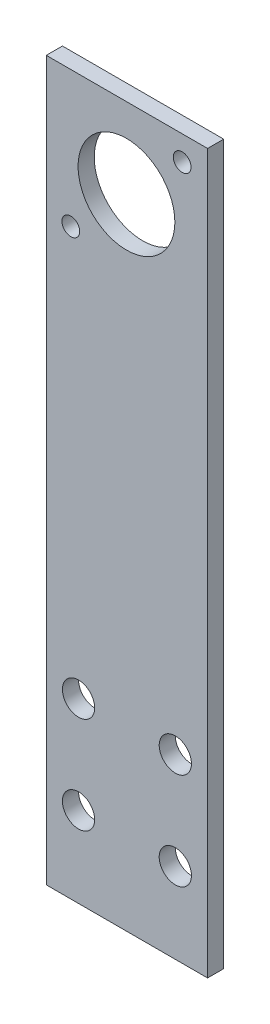
ISO-10303-21;
HEADER;
FILE_DESCRIPTION(('STEP AP214'),'2;1');
FILE_NAME('part.step','',(''),(''),'','','');
FILE_SCHEMA(('AUTOMOTIVE_DESIGN { 1 0 10303 214 1 1 1 1 }'));
ENDSEC;
DATA;
#1=APPLICATION_CONTEXT('core data for automotive mechanical design processes');
#2=APPLICATION_PROTOCOL_DEFINITION('international standard','automotive_design',2000,#1);
#3=PRODUCT_CONTEXT('',#1,'mechanical');
#4=PRODUCT('Part','Part','',(#3));
#5=PRODUCT_RELATED_PRODUCT_CATEGORY('part','',(#4));
#6=PRODUCT_DEFINITION_FORMATION('','',#4);
#7=PRODUCT_DEFINITION_CONTEXT('part definition',#1,'design');
#8=PRODUCT_DEFINITION('design','',#6,#7);
#9=PRODUCT_DEFINITION_SHAPE('','',#8);
#10=(LENGTH_UNIT() NAMED_UNIT(*) SI_UNIT(.MILLI.,.METRE.));
#11=(NAMED_UNIT(*) PLANE_ANGLE_UNIT() SI_UNIT($,.RADIAN.));
#12=(NAMED_UNIT(*) SI_UNIT($,.STERADIAN.) SOLID_ANGLE_UNIT());
#13=UNCERTAINTY_MEASURE_WITH_UNIT(LENGTH_MEASURE(1.E-05),#10,'distance_accuracy_value','');
#14=(GEOMETRIC_REPRESENTATION_CONTEXT(3) GLOBAL_UNCERTAINTY_ASSIGNED_CONTEXT((#13)) GLOBAL_UNIT_ASSIGNED_CONTEXT((#10,
#11,#12)) REPRESENTATION_CONTEXT('',''));
#15=CARTESIAN_POINT('',(0.,0.,0.));
#16=DIRECTION('',(0.,0.,1.));
#17=DIRECTION('',(1.,0.,0.));
#18=AXIS2_PLACEMENT_3D('',#15,#16,#17);
#19=CARTESIAN_POINT('',(0.,0.,3.175));
#20=DIRECTION('',(1.,0.,0.));
#21=DIRECTION('',(0.,0.,-1.));
#22=AXIS2_PLACEMENT_3D('',#19,#20,#21);
#23=PLANE('',#22);
#24=DIRECTION('',(0.,-1.,0.));
#25=VECTOR('',#24,1.);
#26=CARTESIAN_POINT('',(0.,0.,0.));
#27=LINE('',#26,#25);
#28=CARTESIAN_POINT('',(0.,147.32,0.));
#29=VERTEX_POINT('',#28);
#30=CARTESIAN_POINT('',(0.,5.9055,0.));
#31=VERTEX_POINT('',#30);
#32=EDGE_CURVE('E81',#29,#31,#27,.T.);
#33=ORIENTED_EDGE('',*,*,#32,.T.);
#34=DIRECTION('',(0.,0.,1.));
#35=VECTOR('',#34,1.);
#36=CARTESIAN_POINT('',(0.,5.9055,-0.00100000000000013));
#37=LINE('',#36,#35);
#38=CARTESIAN_POINT('',(0.,5.9055,3.175));
#39=VERTEX_POINT('',#38);
#40=EDGE_CURVE('E47',#31,#39,#37,.T.);
#41=ORIENTED_EDGE('',*,*,#40,.T.);
#42=DIRECTION('',(0.,-1.,0.));
#43=VECTOR('',#42,1.);
#44=CARTESIAN_POINT('',(0.,0.,3.175));
#45=LINE('',#44,#43);
#46=CARTESIAN_POINT('',(0.,147.32,3.175));
#47=VERTEX_POINT('',#46);
#48=EDGE_CURVE('E76',#47,#39,#45,.T.);
#49=ORIENTED_EDGE('',*,*,#48,.F.);
#50=DIRECTION('',(0.,0.,-1.));
#51=VECTOR('',#50,1.);
#52=CARTESIAN_POINT('',(0.,147.32,3.175));
#53=LINE('',#52,#51);
#54=EDGE_CURVE('E40',#47,#29,#53,.T.);
#55=ORIENTED_EDGE('',*,*,#54,.T.);
#56=EDGE_LOOP('',(#33,#41,#49,#55));
#57=FACE_BOUND('',#56,.T.);
#58=ADVANCED_FACE('F33',(#57),#23,.F.);
#59=CARTESIAN_POINT('',(31.75,0.,3.175));
#60=DIRECTION('',(-1.,0.,0.));
#61=DIRECTION('',(0.,0.,1.));
#62=AXIS2_PLACEMENT_3D('',#59,#60,#61);
#63=PLANE('',#62);
#64=DIRECTION('',(0.,1.,0.));
#65=VECTOR('',#64,1.);
#66=CARTESIAN_POINT('',(31.75,0.,3.175));
#67=LINE('',#66,#65);
#68=CARTESIAN_POINT('',(31.75,5.9055,3.175));
#69=VERTEX_POINT('',#68);
#70=CARTESIAN_POINT('',(31.75,147.32,3.175));
#71=VERTEX_POINT('',#70);
#72=EDGE_CURVE('E90',#69,#71,#67,.T.);
#73=ORIENTED_EDGE('',*,*,#72,.F.);
#74=DIRECTION('',(0.,0.,1.));
#75=VECTOR('',#74,1.);
#76=CARTESIAN_POINT('',(31.75,5.9055,-0.00100000000000013));
#77=LINE('',#76,#75);
#78=CARTESIAN_POINT('',(31.75,5.9055,0.));
#79=VERTEX_POINT('',#78);
#80=EDGE_CURVE('E86',#79,#69,#77,.T.);
#81=ORIENTED_EDGE('',*,*,#80,.F.);
#82=DIRECTION('',(0.,1.,0.));
#83=VECTOR('',#82,1.);
#84=CARTESIAN_POINT('',(31.75,0.,0.));
#85=LINE('',#84,#83);
#86=CARTESIAN_POINT('',(31.75,147.32,0.));
#87=VERTEX_POINT('',#86);
#88=EDGE_CURVE('E77',#79,#87,#85,.T.);
#89=ORIENTED_EDGE('',*,*,#88,.T.);
#90=DIRECTION('',(0.,0.,-1.));
#91=VECTOR('',#90,1.);
#92=CARTESIAN_POINT('',(31.75,147.32,3.175));
#93=LINE('',#92,#91);
#94=EDGE_CURVE('E11',#71,#87,#93,.T.);
#95=ORIENTED_EDGE('',*,*,#94,.F.);
#96=EDGE_LOOP('',(#73,#81,#89,#95));
#97=FACE_BOUND('',#96,.T.);
#98=ADVANCED_FACE('F159',(#97),#63,.F.);
#99=CARTESIAN_POINT('',(0.,147.32,3.175));
#100=DIRECTION('',(0.,-1.,0.));
#101=DIRECTION('',(0.,0.,-1.));
#102=AXIS2_PLACEMENT_3D('',#99,#100,#101);
#103=PLANE('',#102);
#104=DIRECTION('',(-1.,0.,0.));
#105=VECTOR('',#104,1.);
#106=CARTESIAN_POINT('',(0.,147.32,0.));
#107=LINE('',#106,#105);
#108=EDGE_CURVE('E68',#87,#29,#107,.T.);
#109=ORIENTED_EDGE('',*,*,#108,.T.);
#110=ORIENTED_EDGE('',*,*,#54,.F.);
#111=DIRECTION('',(-1.,0.,0.));
#112=VECTOR('',#111,1.);
#113=CARTESIAN_POINT('',(0.,147.32,3.175));
#114=LINE('',#113,#112);
#115=EDGE_CURVE('E56',#71,#47,#114,.T.);
#116=ORIENTED_EDGE('',*,*,#115,.F.);
#117=ORIENTED_EDGE('',*,*,#94,.T.);
#118=EDGE_LOOP('',(#109,#110,#116,#117));
#119=FACE_BOUND('',#118,.T.);
#120=ADVANCED_FACE('F70',(#119),#103,.F.);
#121=CARTESIAN_POINT('',(0.,0.,3.175));
#122=DIRECTION('',(0.,0.,-1.));
#123=DIRECTION('',(-1.,0.,0.));
#124=AXIS2_PLACEMENT_3D('',#121,#122,#123);
#125=PLANE('',#124);
#126=CARTESIAN_POINT('',(15.7861000000004,131.5339,3.175));
#127=DIRECTION('',(0.,0.,1.));
#128=DIRECTION('',(1.,0.,0.));
#129=AXIS2_PLACEMENT_3D('',#126,#127,#128);
#130=CIRCLE('',#129,9.525);
#131=CARTESIAN_POINT('',(25.3111000000004,131.5339,3.175));
#132=VERTEX_POINT('',#131);
#133=EDGE_CURVE('E129',#132,#132,#130,.T.);
#134=ORIENTED_EDGE('',*,*,#133,.F.);
#135=EDGE_LOOP('',(#134));
#136=FACE_BOUND('',#135,.T.);
#137=CARTESIAN_POINT('',(26.7462000000004,142.494,3.175));
#138=DIRECTION('',(0.,0.,1.));
#139=DIRECTION('',(1.,0.,0.));
#140=AXIS2_PLACEMENT_3D('',#137,#138,#139);
#141=CIRCLE('',#140,1.7526);
#142=CARTESIAN_POINT('',(28.4988000000004,142.494,3.175));
#143=VERTEX_POINT('',#142);
#144=EDGE_CURVE('E135',#143,#143,#141,.T.);
#145=ORIENTED_EDGE('',*,*,#144,.F.);
#146=EDGE_LOOP('',(#145));
#147=FACE_BOUND('',#146,.T.);
#148=CARTESIAN_POINT('',(4.82600000000036,120.5738,3.175));
#149=DIRECTION('',(0.,0.,1.));
#150=DIRECTION('',(1.,0.,0.));
#151=AXIS2_PLACEMENT_3D('',#148,#149,#150);
#152=CIRCLE('',#151,1.7526);
#153=CARTESIAN_POINT('',(6.57860000000036,120.5738,3.175));
#154=VERTEX_POINT('',#153);
#155=EDGE_CURVE('E123',#154,#154,#152,.T.);
#156=ORIENTED_EDGE('',*,*,#155,.F.);
#157=EDGE_LOOP('',(#156));
#158=FACE_BOUND('',#157,.T.);
#159=CARTESIAN_POINT('',(25.4,21.7805,3.175));
#160=DIRECTION('',(0.,0.,1.));
#161=DIRECTION('',(1.,0.,0.));
#162=AXIS2_PLACEMENT_3D('',#159,#160,#161);
#163=CIRCLE('',#162,3.175);
#164=CARTESIAN_POINT('',(28.575,21.7805,3.175));
#165=VERTEX_POINT('',#164);
#166=EDGE_CURVE('E108',#165,#165,#163,.T.);
#167=ORIENTED_EDGE('',*,*,#166,.F.);
#168=EDGE_LOOP('',(#167));
#169=FACE_BOUND('',#168,.T.);
#170=CARTESIAN_POINT('',(6.35,21.7805,3.175));
#171=DIRECTION('',(0.,0.,1.));
#172=DIRECTION('',(1.,0.,0.));
#173=AXIS2_PLACEMENT_3D('',#170,#171,#172);
#174=CIRCLE('',#173,3.175);
#175=CARTESIAN_POINT('',(9.525,21.7805,3.175));
#176=VERTEX_POINT('',#175);
#177=EDGE_CURVE('E115',#176,#176,#174,.T.);
#178=ORIENTED_EDGE('',*,*,#177,.F.);
#179=EDGE_LOOP('',(#178));
#180=FACE_BOUND('',#179,.T.);
#181=CARTESIAN_POINT('',(6.35,40.8305,3.175));
#182=DIRECTION('',(0.,0.,1.));
#183=DIRECTION('',(1.,0.,0.));
#184=AXIS2_PLACEMENT_3D('',#181,#182,#183);
#185=CIRCLE('',#184,3.175);
#186=CARTESIAN_POINT('',(9.525,40.8305,3.175));
#187=VERTEX_POINT('',#186);
#188=EDGE_CURVE('E102',#187,#187,#185,.T.);
#189=ORIENTED_EDGE('',*,*,#188,.F.);
#190=EDGE_LOOP('',(#189));
#191=FACE_BOUND('',#190,.T.);
#192=CARTESIAN_POINT('',(25.4,40.8305,3.175));
#193=DIRECTION('',(0.,0.,1.));
#194=DIRECTION('',(1.,0.,0.));
#195=AXIS2_PLACEMENT_3D('',#192,#193,#194);
#196=CIRCLE('',#195,3.175);
#197=CARTESIAN_POINT('',(28.575,40.8305,3.175));
#198=VERTEX_POINT('',#197);
#199=EDGE_CURVE('E98',#198,#198,#196,.T.);
#200=ORIENTED_EDGE('',*,*,#199,.F.);
#201=EDGE_LOOP('',(#200));
#202=FACE_BOUND('',#201,.T.);
#203=ORIENTED_EDGE('',*,*,#48,.T.);
#204=DIRECTION('',(-1.,0.,0.));
#205=VECTOR('',#204,1.);
#206=CARTESIAN_POINT('',(0.,5.9055,3.175));
#207=LINE('',#206,#205);
#208=EDGE_CURVE('E94',#69,#39,#207,.T.);
#209=ORIENTED_EDGE('',*,*,#208,.F.);
#210=ORIENTED_EDGE('',*,*,#72,.T.);
#211=ORIENTED_EDGE('',*,*,#115,.T.);
#212=EDGE_LOOP('',(#203,#209,#210,#211));
#213=FACE_BOUND('',#212,.T.);
#214=ADVANCED_FACE('F167',(#136,#147,#158,#169,#180,#191,#202,#213),#125,.F.);
#215=CARTESIAN_POINT('',(0.,0.,0.));
#216=DIRECTION('',(0.,0.,-1.));
#217=DIRECTION('',(-1.,0.,0.));
#218=AXIS2_PLACEMENT_3D('',#215,#216,#217);
#219=PLANE('',#218);
#220=CARTESIAN_POINT('',(15.7861000000004,131.5339,0.));
#221=DIRECTION('',(0.,0.,1.));
#222=DIRECTION('',(1.,0.,0.));
#223=AXIS2_PLACEMENT_3D('',#220,#221,#222);
#224=CIRCLE('',#223,9.525);
#225=CARTESIAN_POINT('',(25.3111000000004,131.5339,0.));
#226=VERTEX_POINT('',#225);
#227=EDGE_CURVE('E126',#226,#226,#224,.T.);
#228=ORIENTED_EDGE('',*,*,#227,.T.);
#229=EDGE_LOOP('',(#228));
#230=FACE_BOUND('',#229,.T.);
#231=CARTESIAN_POINT('',(26.7462000000004,142.494,0.));
#232=DIRECTION('',(0.,0.,1.));
#233=DIRECTION('',(1.,0.,0.));
#234=AXIS2_PLACEMENT_3D('',#231,#232,#233);
#235=CIRCLE('',#234,1.7526);
#236=CARTESIAN_POINT('',(28.4988000000004,142.494,0.));
#237=VERTEX_POINT('',#236);
#238=EDGE_CURVE('E132',#237,#237,#235,.T.);
#239=ORIENTED_EDGE('',*,*,#238,.T.);
#240=EDGE_LOOP('',(#239));
#241=FACE_BOUND('',#240,.T.);
#242=CARTESIAN_POINT('',(4.82600000000036,120.5738,0.));
#243=DIRECTION('',(0.,0.,1.));
#244=DIRECTION('',(1.,0.,0.));
#245=AXIS2_PLACEMENT_3D('',#242,#243,#244);
#246=CIRCLE('',#245,1.7526);
#247=CARTESIAN_POINT('',(6.57860000000036,120.5738,0.));
#248=VERTEX_POINT('',#247);
#249=EDGE_CURVE('E109',#248,#248,#246,.T.);
#250=ORIENTED_EDGE('',*,*,#249,.T.);
#251=EDGE_LOOP('',(#250));
#252=FACE_BOUND('',#251,.T.);
#253=CARTESIAN_POINT('',(25.4,21.7805,0.));
#254=DIRECTION('',(0.,0.,-1.));
#255=DIRECTION('',(-1.,0.,0.));
#256=AXIS2_PLACEMENT_3D('',#253,#254,#255);
#257=CIRCLE('',#256,3.175);
#258=CARTESIAN_POINT('',(22.225,21.7805,0.));
#259=VERTEX_POINT('',#258);
#260=EDGE_CURVE('E105',#259,#259,#257,.F.);
#261=ORIENTED_EDGE('',*,*,#260,.T.);
#262=EDGE_LOOP('',(#261));
#263=FACE_BOUND('',#262,.T.);
#264=CARTESIAN_POINT('',(6.35,21.7805,0.));
#265=DIRECTION('',(0.,0.,-1.));
#266=DIRECTION('',(-1.,0.,0.));
#267=AXIS2_PLACEMENT_3D('',#264,#265,#266);
#268=CIRCLE('',#267,3.175);
#269=CARTESIAN_POINT('',(3.175,21.7805,0.));
#270=VERTEX_POINT('',#269);
#271=EDGE_CURVE('E112',#270,#270,#268,.F.);
#272=ORIENTED_EDGE('',*,*,#271,.T.);
#273=EDGE_LOOP('',(#272));
#274=FACE_BOUND('',#273,.T.);
#275=CARTESIAN_POINT('',(6.35,40.8305,0.));
#276=DIRECTION('',(0.,0.,-1.));
#277=DIRECTION('',(-1.,0.,0.));
#278=AXIS2_PLACEMENT_3D('',#275,#276,#277);
#279=CIRCLE('',#278,3.175);
#280=CARTESIAN_POINT('',(3.175,40.8305,0.));
#281=VERTEX_POINT('',#280);
#282=EDGE_CURVE('E118',#281,#281,#279,.F.);
#283=ORIENTED_EDGE('',*,*,#282,.T.);
#284=EDGE_LOOP('',(#283));
#285=FACE_BOUND('',#284,.T.);
#286=CARTESIAN_POINT('',(25.4,40.8305,0.));
#287=DIRECTION('',(0.,0.,-1.));
#288=DIRECTION('',(-1.,0.,0.));
#289=AXIS2_PLACEMENT_3D('',#286,#287,#288);
#290=CIRCLE('',#289,3.175);
#291=CARTESIAN_POINT('',(22.225,40.8305,0.));
#292=VERTEX_POINT('',#291);
#293=EDGE_CURVE('E99',#292,#292,#290,.F.);
#294=ORIENTED_EDGE('',*,*,#293,.T.);
#295=EDGE_LOOP('',(#294));
#296=FACE_BOUND('',#295,.T.);
#297=DIRECTION('',(-1.,0.,0.));
#298=VECTOR('',#297,1.);
#299=CARTESIAN_POINT('',(0.,5.9055,0.));
#300=LINE('',#299,#298);
#301=EDGE_CURVE('E83',#79,#31,#300,.T.);
#302=ORIENTED_EDGE('',*,*,#301,.T.);
#303=ORIENTED_EDGE('',*,*,#32,.F.);
#304=ORIENTED_EDGE('',*,*,#108,.F.);
#305=ORIENTED_EDGE('',*,*,#88,.F.);
#306=EDGE_LOOP('',(#302,#303,#304,#305));
#307=FACE_BOUND('',#306,.T.);
#308=ADVANCED_FACE('F82',(#230,#241,#252,#263,#274,#285,#296,#307),#219,.T.);
#309=CARTESIAN_POINT('',(0.,5.9055,-0.00100000000000013));
#310=DIRECTION('',(0.,1.,0.));
#311=DIRECTION('',(0.,0.,1.));
#312=AXIS2_PLACEMENT_3D('',#309,#310,#311);
#313=PLANE('',#312);
#314=ORIENTED_EDGE('',*,*,#80,.T.);
#315=ORIENTED_EDGE('',*,*,#208,.T.);
#316=ORIENTED_EDGE('',*,*,#40,.F.);
#317=ORIENTED_EDGE('',*,*,#301,.F.);
#318=EDGE_LOOP('',(#314,#315,#316,#317));
#319=FACE_BOUND('',#318,.T.);
#320=ADVANCED_FACE('F173',(#319),#313,.F.);
#321=CARTESIAN_POINT('',(25.4,40.8305,-0.00100000000000013));
#322=DIRECTION('',(0.,0.,1.));
#323=DIRECTION('',(1.,0.,0.));
#324=AXIS2_PLACEMENT_3D('',#321,#322,#323);
#325=CYLINDRICAL_SURFACE('',#324,3.175);
#326=ORIENTED_EDGE('',*,*,#293,.F.);
#327=EDGE_LOOP('',(#326));
#328=FACE_BOUND('',#327,.T.);
#329=ORIENTED_EDGE('',*,*,#199,.T.);
#330=EDGE_LOOP('',(#329));
#331=FACE_BOUND('',#330,.T.);
#332=ADVANCED_FACE('F180',(#328,#331),#325,.F.);
#333=CARTESIAN_POINT('',(6.35,40.8305,-0.00100000000000013));
#334=DIRECTION('',(0.,0.,1.));
#335=DIRECTION('',(1.,0.,0.));
#336=AXIS2_PLACEMENT_3D('',#333,#334,#335);
#337=CYLINDRICAL_SURFACE('',#336,3.175);
#338=ORIENTED_EDGE('',*,*,#282,.F.);
#339=EDGE_LOOP('',(#338));
#340=FACE_BOUND('',#339,.T.);
#341=ORIENTED_EDGE('',*,*,#188,.T.);
#342=EDGE_LOOP('',(#341));
#343=FACE_BOUND('',#342,.T.);
#344=ADVANCED_FACE('F183',(#340,#343),#337,.F.);
#345=CARTESIAN_POINT('',(6.35,21.7805,-0.00100000000000013));
#346=DIRECTION('',(0.,0.,1.));
#347=DIRECTION('',(1.,0.,0.));
#348=AXIS2_PLACEMENT_3D('',#345,#346,#347);
#349=CYLINDRICAL_SURFACE('',#348,3.175);
#350=ORIENTED_EDGE('',*,*,#271,.F.);
#351=EDGE_LOOP('',(#350));
#352=FACE_BOUND('',#351,.T.);
#353=ORIENTED_EDGE('',*,*,#177,.T.);
#354=EDGE_LOOP('',(#353));
#355=FACE_BOUND('',#354,.T.);
#356=ADVANCED_FACE('F187',(#352,#355),#349,.F.);
#357=CARTESIAN_POINT('',(25.4,21.7805,-0.00100000000000013));
#358=DIRECTION('',(0.,0.,1.));
#359=DIRECTION('',(1.,0.,0.));
#360=AXIS2_PLACEMENT_3D('',#357,#358,#359);
#361=CYLINDRICAL_SURFACE('',#360,3.175);
#362=ORIENTED_EDGE('',*,*,#260,.F.);
#363=EDGE_LOOP('',(#362));
#364=FACE_BOUND('',#363,.T.);
#365=ORIENTED_EDGE('',*,*,#166,.T.);
#366=EDGE_LOOP('',(#365));
#367=FACE_BOUND('',#366,.T.);
#368=ADVANCED_FACE('F155',(#364,#367),#361,.F.);
#369=CARTESIAN_POINT('',(4.82600000000036,120.5738,0.));
#370=DIRECTION('',(0.,0.,1.));
#371=DIRECTION('',(1.,0.,0.));
#372=AXIS2_PLACEMENT_3D('',#369,#370,#371);
#373=CYLINDRICAL_SURFACE('',#372,1.7526);
#374=ORIENTED_EDGE('',*,*,#155,.T.);
#375=EDGE_LOOP('',(#374));
#376=FACE_BOUND('',#375,.T.);
#377=ORIENTED_EDGE('',*,*,#249,.F.);
#378=EDGE_LOOP('',(#377));
#379=FACE_BOUND('',#378,.T.);
#380=ADVANCED_FACE('F146',(#376,#379),#373,.F.);
#381=CARTESIAN_POINT('',(26.7462000000004,142.494,0.));
#382=DIRECTION('',(0.,0.,1.));
#383=DIRECTION('',(1.,0.,0.));
#384=AXIS2_PLACEMENT_3D('',#381,#382,#383);
#385=CYLINDRICAL_SURFACE('',#384,1.7526);
#386=ORIENTED_EDGE('',*,*,#144,.T.);
#387=EDGE_LOOP('',(#386));
#388=FACE_BOUND('',#387,.T.);
#389=ORIENTED_EDGE('',*,*,#238,.F.);
#390=EDGE_LOOP('',(#389));
#391=FACE_BOUND('',#390,.T.);
#392=ADVANCED_FACE('F143',(#388,#391),#385,.F.);
#393=CARTESIAN_POINT('',(15.7861000000004,131.5339,0.));
#394=DIRECTION('',(0.,0.,1.));
#395=DIRECTION('',(1.,0.,0.));
#396=AXIS2_PLACEMENT_3D('',#393,#394,#395);
#397=CYLINDRICAL_SURFACE('',#396,9.525);
#398=ORIENTED_EDGE('',*,*,#227,.F.);
#399=EDGE_LOOP('',(#398));
#400=FACE_BOUND('',#399,.T.);
#401=ORIENTED_EDGE('',*,*,#133,.T.);
#402=EDGE_LOOP('',(#401));
#403=FACE_BOUND('',#402,.T.);
#404=ADVANCED_FACE('F145',(#400,#403),#397,.F.);
#405=CLOSED_SHELL('',(#58,#98,#120,#214,#308,#320,#332,#344,#356,#368,#380,#392,#404));
#406=MANIFOLD_SOLID_BREP('B2',#405);
#407=ADVANCED_BREP_SHAPE_REPRESENTATION('',(#18,#406),#14);
#408=SHAPE_DEFINITION_REPRESENTATION(#9,#407);
ENDSEC;
END-ISO-10303-21;
